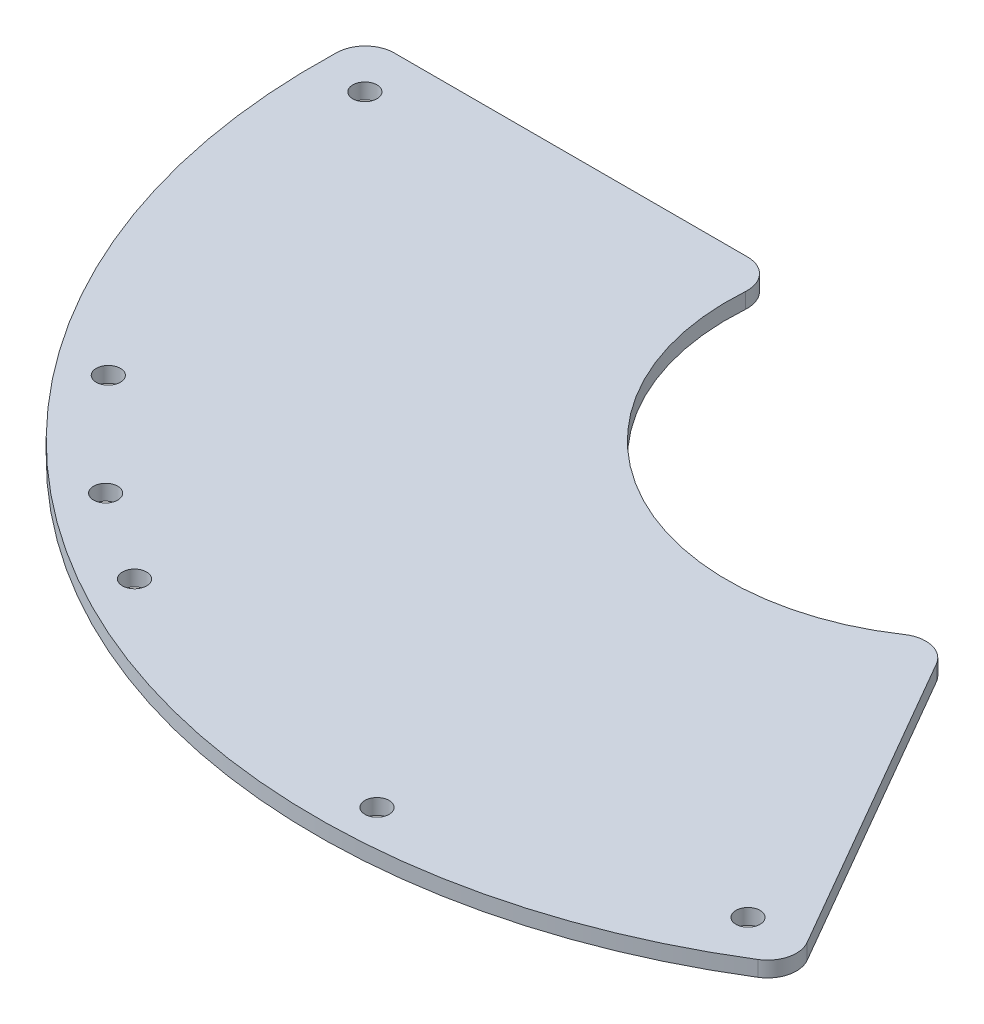
ISO-10303-21;
HEADER;
FILE_DESCRIPTION(('STEP AP214'),'2;1');
FILE_NAME('part.step','',(''),(''),'','','');
FILE_SCHEMA(('AUTOMOTIVE_DESIGN { 1 0 10303 214 1 1 1 1 }'));
ENDSEC;
DATA;
#1=APPLICATION_CONTEXT('core data for automotive mechanical design processes');
#2=APPLICATION_PROTOCOL_DEFINITION('international standard','automotive_design',2000,#1);
#3=PRODUCT_CONTEXT('',#1,'mechanical');
#4=PRODUCT('Part','Part','',(#3));
#5=PRODUCT_RELATED_PRODUCT_CATEGORY('part','',(#4));
#6=PRODUCT_DEFINITION_FORMATION('','',#4);
#7=PRODUCT_DEFINITION_CONTEXT('part definition',#1,'design');
#8=PRODUCT_DEFINITION('design','',#6,#7);
#9=PRODUCT_DEFINITION_SHAPE('','',#8);
#10=(LENGTH_UNIT() NAMED_UNIT(*) SI_UNIT(.MILLI.,.METRE.));
#11=(NAMED_UNIT(*) PLANE_ANGLE_UNIT() SI_UNIT($,.RADIAN.));
#12=(NAMED_UNIT(*) SI_UNIT($,.STERADIAN.) SOLID_ANGLE_UNIT());
#13=UNCERTAINTY_MEASURE_WITH_UNIT(LENGTH_MEASURE(1.E-05),#10,'distance_accuracy_value','');
#14=(GEOMETRIC_REPRESENTATION_CONTEXT(3) GLOBAL_UNCERTAINTY_ASSIGNED_CONTEXT((#13)) GLOBAL_UNIT_ASSIGNED_CONTEXT((#10,
#11,#12)) REPRESENTATION_CONTEXT('',''));
#15=CARTESIAN_POINT('',(0.,0.,0.));
#16=DIRECTION('',(0.,0.,1.));
#17=DIRECTION('',(1.,0.,0.));
#18=AXIS2_PLACEMENT_3D('',#15,#16,#17);
#19=CARTESIAN_POINT('',(0.,0.8,0.));
#20=DIRECTION('',(0.,1.,0.));
#21=DIRECTION('',(0.,0.,1.));
#22=AXIS2_PLACEMENT_3D('',#19,#20,#21);
#23=PLANE('',#22);
#24=CARTESIAN_POINT('',(-39.9618448316641,0.8,49.3487685525181));
#25=DIRECTION('',(0.,1.,0.));
#26=DIRECTION('',(0.,0.,1.));
#27=AXIS2_PLACEMENT_3D('',#24,#25,#26);
#28=CIRCLE('',#27,1.24999999999998);
#29=CARTESIAN_POINT('',(-39.9618448316641,0.8,50.5987685525181));
#30=VERTEX_POINT('',#29);
#31=EDGE_CURVE('E208',#30,#30,#28,.T.);
#32=ORIENTED_EDGE('',*,*,#31,.F.);
#33=EDGE_LOOP('',(#32));
#34=FACE_BOUND('',#33,.T.);
#35=CARTESIAN_POINT('',(2.21611804060919,0.8,63.4613175157126));
#36=DIRECTION('',(0.,1.,0.));
#37=DIRECTION('',(0.,0.,1.));
#38=AXIS2_PLACEMENT_3D('',#35,#36,#37);
#39=CIRCLE('',#38,1.24999999999997);
#40=CARTESIAN_POINT('',(2.21611804060919,0.8,64.7113175157125));
#41=VERTEX_POINT('',#40);
#42=EDGE_CURVE('E196',#41,#41,#39,.T.);
#43=ORIENTED_EDGE('',*,*,#42,.F.);
#44=EDGE_LOOP('',(#43));
#45=FACE_BOUND('',#44,.T.);
#46=CARTESIAN_POINT('',(-62.5,0.8,0.));
#47=DIRECTION('',(0.,1.,0.));
#48=DIRECTION('',(0.,0.,1.));
#49=AXIS2_PLACEMENT_3D('',#46,#47,#48);
#50=CIRCLE('',#49,1.25000000000003);
#51=CARTESIAN_POINT('',(-62.5,0.8,1.25000000000003));
#52=VERTEX_POINT('',#51);
#53=EDGE_CURVE('E182',#52,#52,#50,.T.);
#54=ORIENTED_EDGE('',*,*,#53,.F.);
#55=EDGE_LOOP('',(#54));
#56=FACE_BOUND('',#55,.T.);
#57=DIRECTION('',(-0.500000000000006,0.,-0.866025403784435));
#58=VECTOR('',#57,1.);
#59=CARTESIAN_POINT('',(37.9874070635132,0.8,55.7961190818048));
#60=LINE('',#59,#58);
#61=CARTESIAN_POINT('',(36.5646194144916,0.8,53.331778585318));
#62=VERTEX_POINT('',#61);
#63=CARTESIAN_POINT('',(18.2943670626913,0.8,21.6867732448955));
#64=VERTEX_POINT('',#63);
#65=EDGE_CURVE('E177',#62,#64,#60,.T.);
#66=ORIENTED_EDGE('',*,*,#65,.T.);
#67=CARTESIAN_POINT('',(15.696290851338,0.8,23.1867732448955));
#68=DIRECTION('',(0.,1.,0.));
#69=DIRECTION('',(0.,0.,1.));
#70=AXIS2_PLACEMENT_3D('',#67,#68,#69);
#71=CIRCLE('',#70,3.);
#72=CARTESIAN_POINT('',(14.0145454029803,0.8,20.7024761115139));
#73=VERTEX_POINT('',#72);
#74=EDGE_CURVE('E158',#64,#73,#71,.T.);
#75=ORIENTED_EDGE('',*,*,#74,.T.);
#76=CARTESIAN_POINT('',(0.,0.8,0.));
#77=DIRECTION('',(0.,-1.,0.));
#78=DIRECTION('',(0.,0.,1.));
#79=AXIS2_PLACEMENT_3D('',#76,#77,#78);
#80=CIRCLE('',#79,25.);
#81=CARTESIAN_POINT('',(-24.9361429353017,0.8,-1.78571428571429));
#82=VERTEX_POINT('',#81);
#83=EDGE_CURVE('E128',#73,#82,#80,.T.);
#84=ORIENTED_EDGE('',*,*,#83,.T.);
#85=CARTESIAN_POINT('',(-27.9284800875379,0.8,-2.));
#86=DIRECTION('',(0.,1.,0.));
#87=DIRECTION('',(0.,0.,1.));
#88=AXIS2_PLACEMENT_3D('',#85,#86,#87);
#89=CIRCLE('',#88,3.);
#90=CARTESIAN_POINT('',(-27.9284800875379,0.8,-5.));
#91=VERTEX_POINT('',#90);
#92=EDGE_CURVE('E64',#82,#91,#89,.T.);
#93=ORIENTED_EDGE('',*,*,#92,.T.);
#94=DIRECTION('',(-1.,0.,0.));
#95=VECTOR('',#94,1.);
#96=CARTESIAN_POINT('',(-67.3145600891813,0.8,-4.99999999999999));
#97=LINE('',#96,#95);
#98=CARTESIAN_POINT('',(-64.4689847911381,0.8,-4.99999999999999));
#99=VERTEX_POINT('',#98);
#100=EDGE_CURVE('E144',#91,#99,#97,.T.);
#101=ORIENTED_EDGE('',*,*,#100,.T.);
#102=CARTESIAN_POINT('',(-64.4689847911381,0.8,-1.99999999999999));
#103=DIRECTION('',(0.,1.,0.));
#104=DIRECTION('',(0.,0.,1.));
#105=AXIS2_PLACEMENT_3D('',#102,#103,#104);
#106=CIRCLE('',#105,3.);
#107=CARTESIAN_POINT('',(-67.4675422232841,0.8,-2.09302325581395));
#108=VERTEX_POINT('',#107);
#109=EDGE_CURVE('E155',#99,#108,#106,.T.);
#110=ORIENTED_EDGE('',*,*,#109,.T.);
#111=CARTESIAN_POINT('',(0.,0.8,0.));
#112=DIRECTION('',(0.,1.,0.));
#113=DIRECTION('',(0.,0.,1.));
#114=AXIS2_PLACEMENT_3D('',#111,#112,#113);
#115=CIRCLE('',#114,67.5);
#116=CARTESIAN_POINT('',(35.546382421889,0.8,57.382093868356));
#117=VERTEX_POINT('',#116);
#118=EDGE_CURVE('E138',#108,#117,#115,.T.);
#119=ORIENTED_EDGE('',*,*,#118,.T.);
#120=CARTESIAN_POINT('',(33.9665432031383,0.8,54.831778585318));
#121=DIRECTION('',(0.,1.,0.));
#122=DIRECTION('',(0.,0.,1.));
#123=AXIS2_PLACEMENT_3D('',#120,#121,#122);
#124=CIRCLE('',#123,3.);
#125=EDGE_CURVE('E153',#117,#62,#124,.T.);
#126=ORIENTED_EDGE('',*,*,#125,.T.);
#127=EDGE_LOOP('',(#66,#75,#84,#93,#101,#110,#119,#126));
#128=FACE_BOUND('',#127,.T.);
#129=CARTESIAN_POINT('',(31.2500000000004,0.8,54.1265877365272));
#130=DIRECTION('',(0.,1.,0.));
#131=DIRECTION('',(0.,0.,1.));
#132=AXIS2_PLACEMENT_3D('',#129,#130,#131);
#133=CIRCLE('',#132,1.25);
#134=CARTESIAN_POINT('',(31.2500000000004,0.8,55.3765877365272));
#135=VERTEX_POINT('',#134);
#136=EDGE_CURVE('E191',#135,#135,#133,.T.);
#137=ORIENTED_EDGE('',*,*,#136,.F.);
#138=EDGE_LOOP('',(#137));
#139=FACE_BOUND('',#138,.T.);
#140=CARTESIAN_POINT('',(-30.7854108856423,0.8,55.5383514033517));
#141=DIRECTION('',(0.,1.,0.));
#142=DIRECTION('',(0.,0.,1.));
#143=AXIS2_PLACEMENT_3D('',#140,#141,#142);
#144=CIRCLE('',#143,1.25);
#145=CARTESIAN_POINT('',(-30.7854108856423,0.8,56.7883514033517));
#146=VERTEX_POINT('',#145);
#147=EDGE_CURVE('E202',#146,#146,#144,.T.);
#148=ORIENTED_EDGE('',*,*,#147,.F.);
#149=EDGE_LOOP('',(#148));
#150=FACE_BOUND('',#149,.T.);
#151=CARTESIAN_POINT('',(-50.3779371084933,0.8,38.6563507420539));
#152=DIRECTION('',(0.,1.,0.));
#153=DIRECTION('',(0.,0.,1.));
#154=AXIS2_PLACEMENT_3D('',#151,#152,#153);
#155=CIRCLE('',#154,1.24999999999999);
#156=CARTESIAN_POINT('',(-50.3779371084933,0.8,39.9063507420539));
#157=VERTEX_POINT('',#156);
#158=EDGE_CURVE('E214',#157,#157,#155,.T.);
#159=ORIENTED_EDGE('',*,*,#158,.F.);
#160=EDGE_LOOP('',(#159));
#161=FACE_BOUND('',#160,.T.);
#162=ADVANCED_FACE('F42',(#34,#45,#56,#128,#139,#150,#161),#23,.T.);
#163=CARTESIAN_POINT('',(0.,-0.8,0.));
#164=DIRECTION('',(0.,1.,0.));
#165=DIRECTION('',(0.,0.,1.));
#166=AXIS2_PLACEMENT_3D('',#163,#164,#165);
#167=PLANE('',#166);
#168=CARTESIAN_POINT('',(0.,-0.8,0.));
#169=DIRECTION('',(0.,-1.,0.));
#170=DIRECTION('',(0.,0.,1.));
#171=AXIS2_PLACEMENT_3D('',#168,#169,#170);
#172=CIRCLE('',#171,25.);
#173=CARTESIAN_POINT('',(14.0145454029803,-0.8,20.7024761115139));
#174=VERTEX_POINT('',#173);
#175=CARTESIAN_POINT('',(-24.9361429353017,-0.8,-1.78571428571429));
#176=VERTEX_POINT('',#175);
#177=EDGE_CURVE('E126',#174,#176,#172,.T.);
#178=ORIENTED_EDGE('',*,*,#177,.F.);
#179=CARTESIAN_POINT('',(15.696290851338,-0.8,23.1867732448955));
#180=DIRECTION('',(0.,1.,0.));
#181=DIRECTION('',(0.,0.,1.));
#182=AXIS2_PLACEMENT_3D('',#179,#180,#181);
#183=CIRCLE('',#182,3.);
#184=CARTESIAN_POINT('',(18.2943670626913,-0.8,21.6867732448955));
#185=VERTEX_POINT('',#184);
#186=EDGE_CURVE('E109',#174,#185,#183,.F.);
#187=ORIENTED_EDGE('',*,*,#186,.T.);
#188=DIRECTION('',(-0.500000000000006,0.,-0.866025403784435));
#189=VECTOR('',#188,1.);
#190=CARTESIAN_POINT('',(37.9874070635132,-0.8,55.7961190818048));
#191=LINE('',#190,#189);
#192=CARTESIAN_POINT('',(36.5646194144916,-0.8,53.331778585318));
#193=VERTEX_POINT('',#192);
#194=EDGE_CURVE('E136',#193,#185,#191,.T.);
#195=ORIENTED_EDGE('',*,*,#194,.F.);
#196=CARTESIAN_POINT('',(33.9665432031383,-0.8,54.831778585318));
#197=DIRECTION('',(0.,1.,0.));
#198=DIRECTION('',(0.,0.,1.));
#199=AXIS2_PLACEMENT_3D('',#196,#197,#198);
#200=CIRCLE('',#199,3.);
#201=CARTESIAN_POINT('',(35.546382421889,-0.8,57.382093868356));
#202=VERTEX_POINT('',#201);
#203=EDGE_CURVE('E129',#193,#202,#200,.F.);
#204=ORIENTED_EDGE('',*,*,#203,.T.);
#205=CARTESIAN_POINT('',(0.,-0.8,0.));
#206=DIRECTION('',(0.,1.,0.));
#207=DIRECTION('',(0.,0.,1.));
#208=AXIS2_PLACEMENT_3D('',#205,#206,#207);
#209=CIRCLE('',#208,67.5);
#210=CARTESIAN_POINT('',(-67.4675422232841,-0.8,-2.09302325581395));
#211=VERTEX_POINT('',#210);
#212=EDGE_CURVE('E140',#211,#202,#209,.T.);
#213=ORIENTED_EDGE('',*,*,#212,.F.);
#214=CARTESIAN_POINT('',(-64.4689847911381,-0.8,-1.99999999999999));
#215=DIRECTION('',(0.,1.,0.));
#216=DIRECTION('',(0.,0.,1.));
#217=AXIS2_PLACEMENT_3D('',#214,#215,#216);
#218=CIRCLE('',#217,3.);
#219=CARTESIAN_POINT('',(-64.4689847911381,-0.8,-4.99999999999999));
#220=VERTEX_POINT('',#219);
#221=EDGE_CURVE('E147',#211,#220,#218,.F.);
#222=ORIENTED_EDGE('',*,*,#221,.T.);
#223=DIRECTION('',(-1.,0.,0.));
#224=VECTOR('',#223,1.);
#225=CARTESIAN_POINT('',(-67.3145600891813,-0.8,-4.99999999999999));
#226=LINE('',#225,#224);
#227=CARTESIAN_POINT('',(-27.9284800875379,-0.8,-5.));
#228=VERTEX_POINT('',#227);
#229=EDGE_CURVE('E135',#228,#220,#226,.T.);
#230=ORIENTED_EDGE('',*,*,#229,.F.);
#231=CARTESIAN_POINT('',(-27.9284800875379,-0.8,-2.));
#232=DIRECTION('',(0.,1.,0.));
#233=DIRECTION('',(0.,0.,1.));
#234=AXIS2_PLACEMENT_3D('',#231,#232,#233);
#235=CIRCLE('',#234,3.);
#236=EDGE_CURVE('E120',#228,#176,#235,.F.);
#237=ORIENTED_EDGE('',*,*,#236,.T.);
#238=EDGE_LOOP('',(#178,#187,#195,#204,#213,#222,#230,#237));
#239=FACE_BOUND('',#238,.T.);
#240=CARTESIAN_POINT('',(-62.5,-0.8,0.));
#241=DIRECTION('',(0.,1.,0.));
#242=DIRECTION('',(0.,0.,1.));
#243=AXIS2_PLACEMENT_3D('',#240,#241,#242);
#244=CIRCLE('',#243,1.25000000000003);
#245=CARTESIAN_POINT('',(-62.5,-0.8,1.25000000000003));
#246=VERTEX_POINT('',#245);
#247=EDGE_CURVE('E184',#246,#246,#244,.T.);
#248=ORIENTED_EDGE('',*,*,#247,.T.);
#249=EDGE_LOOP('',(#248));
#250=FACE_BOUND('',#249,.T.);
#251=CARTESIAN_POINT('',(31.2500000000004,-0.8,54.1265877365272));
#252=DIRECTION('',(0.,1.,0.));
#253=DIRECTION('',(0.,0.,1.));
#254=AXIS2_PLACEMENT_3D('',#251,#252,#253);
#255=CIRCLE('',#254,1.25);
#256=CARTESIAN_POINT('',(31.2500000000004,-0.8,55.3765877365272));
#257=VERTEX_POINT('',#256);
#258=EDGE_CURVE('E193',#257,#257,#255,.T.);
#259=ORIENTED_EDGE('',*,*,#258,.T.);
#260=EDGE_LOOP('',(#259));
#261=FACE_BOUND('',#260,.T.);
#262=CARTESIAN_POINT('',(2.21611804060919,-0.8,63.4613175157126));
#263=DIRECTION('',(0.,1.,0.));
#264=DIRECTION('',(0.,0.,1.));
#265=AXIS2_PLACEMENT_3D('',#262,#263,#264);
#266=CIRCLE('',#265,1.24999999999997);
#267=CARTESIAN_POINT('',(2.21611804060919,-0.8,64.7113175157125));
#268=VERTEX_POINT('',#267);
#269=EDGE_CURVE('E199',#268,#268,#266,.T.);
#270=ORIENTED_EDGE('',*,*,#269,.T.);
#271=EDGE_LOOP('',(#270));
#272=FACE_BOUND('',#271,.T.);
#273=CARTESIAN_POINT('',(-30.7854108856423,-0.8,55.5383514033517));
#274=DIRECTION('',(0.,1.,0.));
#275=DIRECTION('',(0.,0.,1.));
#276=AXIS2_PLACEMENT_3D('',#273,#274,#275);
#277=CIRCLE('',#276,1.25);
#278=CARTESIAN_POINT('',(-30.7854108856423,-0.8,56.7883514033517));
#279=VERTEX_POINT('',#278);
#280=EDGE_CURVE('E205',#279,#279,#277,.T.);
#281=ORIENTED_EDGE('',*,*,#280,.T.);
#282=EDGE_LOOP('',(#281));
#283=FACE_BOUND('',#282,.T.);
#284=CARTESIAN_POINT('',(-39.9618448316641,-0.8,49.3487685525181));
#285=DIRECTION('',(0.,1.,0.));
#286=DIRECTION('',(0.,0.,1.));
#287=AXIS2_PLACEMENT_3D('',#284,#285,#286);
#288=CIRCLE('',#287,1.24999999999998);
#289=CARTESIAN_POINT('',(-39.9618448316641,-0.8,50.5987685525181));
#290=VERTEX_POINT('',#289);
#291=EDGE_CURVE('E211',#290,#290,#288,.T.);
#292=ORIENTED_EDGE('',*,*,#291,.T.);
#293=EDGE_LOOP('',(#292));
#294=FACE_BOUND('',#293,.T.);
#295=CARTESIAN_POINT('',(-50.3779371084933,-0.8,38.6563507420539));
#296=DIRECTION('',(0.,1.,0.));
#297=DIRECTION('',(0.,0.,1.));
#298=AXIS2_PLACEMENT_3D('',#295,#296,#297);
#299=CIRCLE('',#298,1.24999999999999);
#300=CARTESIAN_POINT('',(-50.3779371084933,-0.8,39.9063507420539));
#301=VERTEX_POINT('',#300);
#302=EDGE_CURVE('E217',#301,#301,#299,.T.);
#303=ORIENTED_EDGE('',*,*,#302,.T.);
#304=EDGE_LOOP('',(#303));
#305=FACE_BOUND('',#304,.T.);
#306=ADVANCED_FACE('F132',(#239,#250,#261,#272,#283,#294,#305),#167,.F.);
#307=CARTESIAN_POINT('',(0.,0.8,0.));
#308=DIRECTION('',(0.,-1.,0.));
#309=DIRECTION('',(0.,0.,-1.));
#310=AXIS2_PLACEMENT_3D('',#307,#308,#309);
#311=CYLINDRICAL_SURFACE('',#310,67.5);
#312=ORIENTED_EDGE('',*,*,#118,.F.);
#313=DIRECTION('',(0.,-1.,0.));
#314=VECTOR('',#313,1.);
#315=CARTESIAN_POINT('',(-67.4675422232841,0.8,-2.09302325581395));
#316=LINE('',#315,#314);
#317=EDGE_CURVE('E11',#108,#211,#316,.T.);
#318=ORIENTED_EDGE('',*,*,#317,.T.);
#319=ORIENTED_EDGE('',*,*,#212,.T.);
#320=DIRECTION('',(0.,-1.,0.));
#321=VECTOR('',#320,1.);
#322=CARTESIAN_POINT('',(35.546382421889,0.8,57.382093868356));
#323=LINE('',#322,#321);
#324=EDGE_CURVE('E50',#202,#117,#323,.F.);
#325=ORIENTED_EDGE('',*,*,#324,.T.);
#326=EDGE_LOOP('',(#312,#318,#319,#325));
#327=FACE_BOUND('',#326,.T.);
#328=ADVANCED_FACE('F168',(#327),#311,.T.);
#329=CARTESIAN_POINT('',(37.9874070635132,0.8,55.7961190818048));
#330=DIRECTION('',(-0.866025403784435,0.,0.500000000000006));
#331=DIRECTION('',(0.500000000000006,0.,0.866025403784435));
#332=AXIS2_PLACEMENT_3D('',#329,#330,#331);
#333=PLANE('',#332);
#334=ORIENTED_EDGE('',*,*,#194,.T.);
#335=DIRECTION('',(0.,-1.,0.));
#336=VECTOR('',#335,1.);
#337=CARTESIAN_POINT('',(18.2943670626913,0.8,21.6867732448955));
#338=LINE('',#337,#336);
#339=EDGE_CURVE('E114',#185,#64,#338,.F.);
#340=ORIENTED_EDGE('',*,*,#339,.T.);
#341=ORIENTED_EDGE('',*,*,#65,.F.);
#342=DIRECTION('',(0.,-1.,0.));
#343=VECTOR('',#342,1.);
#344=CARTESIAN_POINT('',(36.5646194144916,0.8,53.331778585318));
#345=LINE('',#344,#343);
#346=EDGE_CURVE('E119',#62,#193,#345,.T.);
#347=ORIENTED_EDGE('',*,*,#346,.T.);
#348=EDGE_LOOP('',(#334,#340,#341,#347));
#349=FACE_BOUND('',#348,.T.);
#350=ADVANCED_FACE('F181',(#349),#333,.F.);
#351=CARTESIAN_POINT('',(0.,0.8,0.));
#352=DIRECTION('',(0.,-1.,0.));
#353=DIRECTION('',(0.,0.,-1.));
#354=AXIS2_PLACEMENT_3D('',#351,#352,#353);
#355=CYLINDRICAL_SURFACE('',#354,25.);
#356=ORIENTED_EDGE('',*,*,#83,.F.);
#357=DIRECTION('',(0.,-1.,0.));
#358=VECTOR('',#357,1.);
#359=CARTESIAN_POINT('',(14.0145454029804,0.8,20.7024761115139));
#360=LINE('',#359,#358);
#361=EDGE_CURVE('E113',#73,#174,#360,.T.);
#362=ORIENTED_EDGE('',*,*,#361,.T.);
#363=ORIENTED_EDGE('',*,*,#177,.T.);
#364=DIRECTION('',(0.,-1.,0.));
#365=VECTOR('',#364,1.);
#366=CARTESIAN_POINT('',(-24.9361429353017,0.8,-1.78571428571429));
#367=LINE('',#366,#365);
#368=EDGE_CURVE('E130',#176,#82,#367,.F.);
#369=ORIENTED_EDGE('',*,*,#368,.T.);
#370=EDGE_LOOP('',(#356,#362,#363,#369));
#371=FACE_BOUND('',#370,.T.);
#372=ADVANCED_FACE('F125',(#371),#355,.F.);
#373=CARTESIAN_POINT('',(-67.3145600891813,0.8,-4.99999999999999));
#374=DIRECTION('',(0.,0.,1.));
#375=DIRECTION('',(1.,0.,0.));
#376=AXIS2_PLACEMENT_3D('',#373,#374,#375);
#377=PLANE('',#376);
#378=ORIENTED_EDGE('',*,*,#100,.F.);
#379=DIRECTION('',(0.,-1.,0.));
#380=VECTOR('',#379,1.);
#381=CARTESIAN_POINT('',(-27.9284800875379,0.8,-5.));
#382=LINE('',#381,#380);
#383=EDGE_CURVE('E161',#91,#228,#382,.T.);
#384=ORIENTED_EDGE('',*,*,#383,.T.);
#385=ORIENTED_EDGE('',*,*,#229,.T.);
#386=DIRECTION('',(0.,-1.,0.));
#387=VECTOR('',#386,1.);
#388=CARTESIAN_POINT('',(-64.4689847911381,0.8,-4.99999999999999));
#389=LINE('',#388,#387);
#390=EDGE_CURVE('E57',#220,#99,#389,.F.);
#391=ORIENTED_EDGE('',*,*,#390,.T.);
#392=EDGE_LOOP('',(#378,#384,#385,#391));
#393=FACE_BOUND('',#392,.T.);
#394=ADVANCED_FACE('F239',(#393),#377,.F.);
#395=CARTESIAN_POINT('',(-62.5,0.8,0.));
#396=DIRECTION('',(0.,-1.,0.));
#397=DIRECTION('',(0.,0.,-1.));
#398=AXIS2_PLACEMENT_3D('',#395,#396,#397);
#399=CYLINDRICAL_SURFACE('',#398,1.25000000000003);
#400=ORIENTED_EDGE('',*,*,#53,.T.);
#401=EDGE_LOOP('',(#400));
#402=FACE_BOUND('',#401,.T.);
#403=ORIENTED_EDGE('',*,*,#247,.F.);
#404=EDGE_LOOP('',(#403));
#405=FACE_BOUND('',#404,.T.);
#406=ADVANCED_FACE('F236',(#402,#405),#399,.F.);
#407=CARTESIAN_POINT('',(31.2500000000004,0.8,54.1265877365272));
#408=DIRECTION('',(0.,-1.,0.));
#409=DIRECTION('',(0.,0.,-1.));
#410=AXIS2_PLACEMENT_3D('',#407,#408,#409);
#411=CYLINDRICAL_SURFACE('',#410,1.25);
#412=ORIENTED_EDGE('',*,*,#136,.T.);
#413=EDGE_LOOP('',(#412));
#414=FACE_BOUND('',#413,.T.);
#415=ORIENTED_EDGE('',*,*,#258,.F.);
#416=EDGE_LOOP('',(#415));
#417=FACE_BOUND('',#416,.T.);
#418=ADVANCED_FACE('F368',(#414,#417),#411,.F.);
#419=CARTESIAN_POINT('',(2.21611804060919,0.8,63.4613175157126));
#420=DIRECTION('',(0.,-1.,0.));
#421=DIRECTION('',(0.,0.,-1.));
#422=AXIS2_PLACEMENT_3D('',#419,#420,#421);
#423=CYLINDRICAL_SURFACE('',#422,1.24999999999997);
#424=ORIENTED_EDGE('',*,*,#42,.T.);
#425=EDGE_LOOP('',(#424));
#426=FACE_BOUND('',#425,.T.);
#427=ORIENTED_EDGE('',*,*,#269,.F.);
#428=EDGE_LOOP('',(#427));
#429=FACE_BOUND('',#428,.T.);
#430=ADVANCED_FACE('F357',(#426,#429),#423,.F.);
#431=CARTESIAN_POINT('',(-30.7854108856423,0.8,55.5383514033517));
#432=DIRECTION('',(0.,-1.,0.));
#433=DIRECTION('',(0.,0.,-1.));
#434=AXIS2_PLACEMENT_3D('',#431,#432,#433);
#435=CYLINDRICAL_SURFACE('',#434,1.25);
#436=ORIENTED_EDGE('',*,*,#147,.T.);
#437=EDGE_LOOP('',(#436));
#438=FACE_BOUND('',#437,.T.);
#439=ORIENTED_EDGE('',*,*,#280,.F.);
#440=EDGE_LOOP('',(#439));
#441=FACE_BOUND('',#440,.T.);
#442=ADVANCED_FACE('F346',(#438,#441),#435,.F.);
#443=CARTESIAN_POINT('',(-39.9618448316641,0.8,49.3487685525181));
#444=DIRECTION('',(0.,-1.,0.));
#445=DIRECTION('',(0.,0.,-1.));
#446=AXIS2_PLACEMENT_3D('',#443,#444,#445);
#447=CYLINDRICAL_SURFACE('',#446,1.24999999999998);
#448=ORIENTED_EDGE('',*,*,#31,.T.);
#449=EDGE_LOOP('',(#448));
#450=FACE_BOUND('',#449,.T.);
#451=ORIENTED_EDGE('',*,*,#291,.F.);
#452=EDGE_LOOP('',(#451));
#453=FACE_BOUND('',#452,.T.);
#454=ADVANCED_FACE('F336',(#450,#453),#447,.F.);
#455=CARTESIAN_POINT('',(-50.3779371084933,0.8,38.6563507420539));
#456=DIRECTION('',(0.,-1.,0.));
#457=DIRECTION('',(0.,0.,-1.));
#458=AXIS2_PLACEMENT_3D('',#455,#456,#457);
#459=CYLINDRICAL_SURFACE('',#458,1.24999999999999);
#460=ORIENTED_EDGE('',*,*,#158,.T.);
#461=EDGE_LOOP('',(#460));
#462=FACE_BOUND('',#461,.T.);
#463=ORIENTED_EDGE('',*,*,#302,.F.);
#464=EDGE_LOOP('',(#463));
#465=FACE_BOUND('',#464,.T.);
#466=ADVANCED_FACE('F223',(#462,#465),#459,.F.);
#467=CARTESIAN_POINT('',(15.696290851338,0.8,23.1867732448955));
#468=DIRECTION('',(0.,-1.,0.));
#469=DIRECTION('',(0.,0.,-1.));
#470=AXIS2_PLACEMENT_3D('',#467,#468,#469);
#471=CYLINDRICAL_SURFACE('',#470,3.);
#472=ORIENTED_EDGE('',*,*,#74,.F.);
#473=ORIENTED_EDGE('',*,*,#339,.F.);
#474=ORIENTED_EDGE('',*,*,#186,.F.);
#475=ORIENTED_EDGE('',*,*,#361,.F.);
#476=EDGE_LOOP('',(#472,#473,#474,#475));
#477=FACE_BOUND('',#476,.T.);
#478=ADVANCED_FACE('F112',(#477),#471,.T.);
#479=CARTESIAN_POINT('',(-27.9284800875379,0.8,-2.));
#480=DIRECTION('',(0.,-1.,0.));
#481=DIRECTION('',(0.,0.,-1.));
#482=AXIS2_PLACEMENT_3D('',#479,#480,#481);
#483=CYLINDRICAL_SURFACE('',#482,3.);
#484=ORIENTED_EDGE('',*,*,#92,.F.);
#485=ORIENTED_EDGE('',*,*,#368,.F.);
#486=ORIENTED_EDGE('',*,*,#236,.F.);
#487=ORIENTED_EDGE('',*,*,#383,.F.);
#488=EDGE_LOOP('',(#484,#485,#486,#487));
#489=FACE_BOUND('',#488,.T.);
#490=ADVANCED_FACE('F250',(#489),#483,.T.);
#491=CARTESIAN_POINT('',(-64.4689847911381,0.8,-1.99999999999999));
#492=DIRECTION('',(0.,-1.,0.));
#493=DIRECTION('',(0.,0.,-1.));
#494=AXIS2_PLACEMENT_3D('',#491,#492,#493);
#495=CYLINDRICAL_SURFACE('',#494,3.);
#496=ORIENTED_EDGE('',*,*,#109,.F.);
#497=ORIENTED_EDGE('',*,*,#390,.F.);
#498=ORIENTED_EDGE('',*,*,#221,.F.);
#499=ORIENTED_EDGE('',*,*,#317,.F.);
#500=EDGE_LOOP('',(#496,#497,#498,#499));
#501=FACE_BOUND('',#500,.T.);
#502=ADVANCED_FACE('F252',(#501),#495,.T.);
#503=CARTESIAN_POINT('',(33.9665432031383,0.8,54.831778585318));
#504=DIRECTION('',(0.,-1.,0.));
#505=DIRECTION('',(0.,0.,-1.));
#506=AXIS2_PLACEMENT_3D('',#503,#504,#505);
#507=CYLINDRICAL_SURFACE('',#506,3.);
#508=ORIENTED_EDGE('',*,*,#125,.F.);
#509=ORIENTED_EDGE('',*,*,#324,.F.);
#510=ORIENTED_EDGE('',*,*,#203,.F.);
#511=ORIENTED_EDGE('',*,*,#346,.F.);
#512=EDGE_LOOP('',(#508,#509,#510,#511));
#513=FACE_BOUND('',#512,.T.);
#514=ADVANCED_FACE('F44',(#513),#507,.T.);
#515=CLOSED_SHELL('',(#162,#306,#328,#350,#372,#394,#406,#418,#430,#442,#454,#466,#478,#490,
#502,#514));
#516=MANIFOLD_SOLID_BREP('B2',#515);
#517=ADVANCED_BREP_SHAPE_REPRESENTATION('',(#18,#516),#14);
#518=SHAPE_DEFINITION_REPRESENTATION(#9,#517);
ENDSEC;
END-ISO-10303-21;
